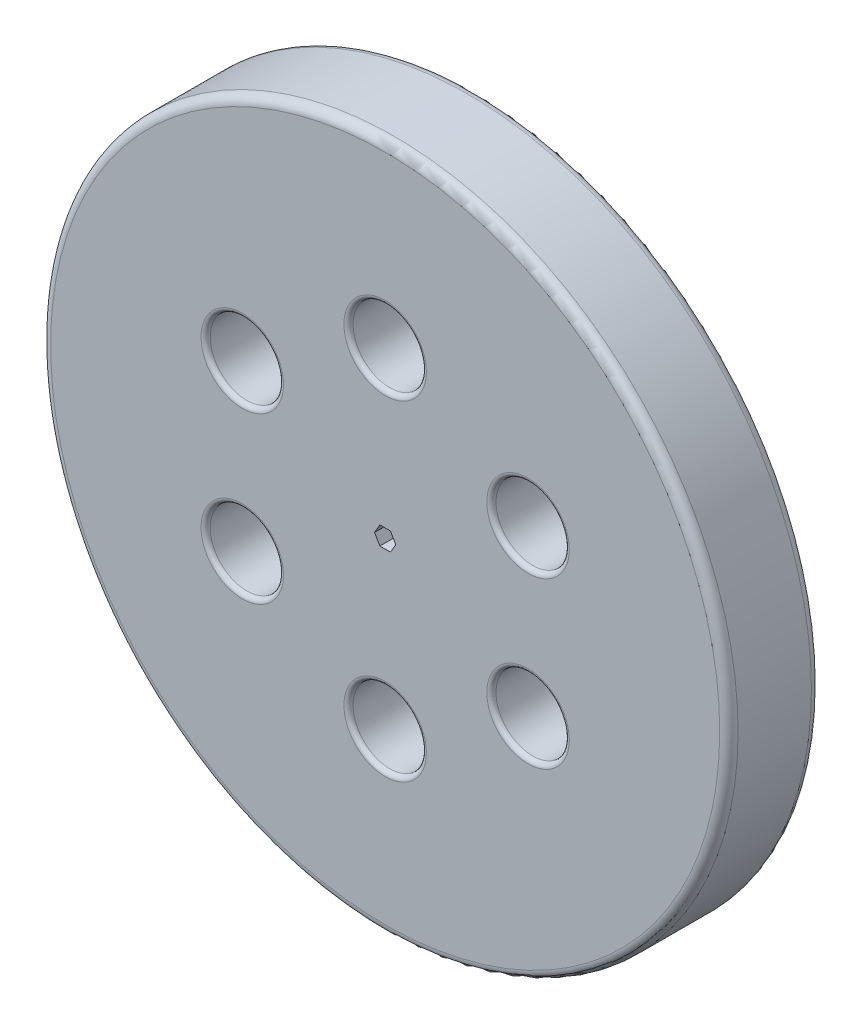
ISO-10303-21;
HEADER;
FILE_DESCRIPTION(('STEP AP214'),'2;1');
FILE_NAME('part.step','',(''),(''),'','','');
FILE_SCHEMA(('AUTOMOTIVE_DESIGN { 1 0 10303 214 1 1 1 1 }'));
ENDSEC;
DATA;
#1=APPLICATION_CONTEXT('core data for automotive mechanical design processes');
#2=APPLICATION_PROTOCOL_DEFINITION('international standard','automotive_design',2000,#1);
#3=PRODUCT_CONTEXT('',#1,'mechanical');
#4=PRODUCT('Part','Part','',(#3));
#5=PRODUCT_RELATED_PRODUCT_CATEGORY('part','',(#4));
#6=PRODUCT_DEFINITION_FORMATION('','',#4);
#7=PRODUCT_DEFINITION_CONTEXT('part definition',#1,'design');
#8=PRODUCT_DEFINITION('design','',#6,#7);
#9=PRODUCT_DEFINITION_SHAPE('','',#8);
#10=(LENGTH_UNIT() NAMED_UNIT(*) SI_UNIT(.MILLI.,.METRE.));
#11=(NAMED_UNIT(*) PLANE_ANGLE_UNIT() SI_UNIT($,.RADIAN.));
#12=(NAMED_UNIT(*) SI_UNIT($,.STERADIAN.) SOLID_ANGLE_UNIT());
#13=UNCERTAINTY_MEASURE_WITH_UNIT(LENGTH_MEASURE(1.E-05),#10,'distance_accuracy_value','');
#14=(GEOMETRIC_REPRESENTATION_CONTEXT(3) GLOBAL_UNCERTAINTY_ASSIGNED_CONTEXT((#13)) GLOBAL_UNIT_ASSIGNED_CONTEXT((#10,
#11,#12)) REPRESENTATION_CONTEXT('',''));
#15=CARTESIAN_POINT('',(0.,0.,0.));
#16=DIRECTION('',(0.,0.,1.));
#17=DIRECTION('',(1.,0.,0.));
#18=AXIS2_PLACEMENT_3D('',#15,#16,#17);
#19=CARTESIAN_POINT('',(0.,0.,10.));
#20=DIRECTION('',(0.,0.,-1.));
#21=DIRECTION('',(-1.,0.,0.));
#22=AXIS2_PLACEMENT_3D('',#19,#20,#21);
#23=CYLINDRICAL_SURFACE('',#22,37.5);
#24=CARTESIAN_POINT('',(0.,0.,0.999999999999999));
#25=DIRECTION('',(0.,0.,1.));
#26=DIRECTION('',(1.,0.,0.));
#27=AXIS2_PLACEMENT_3D('',#24,#25,#26);
#28=CIRCLE('',#27,37.5);
#29=CARTESIAN_POINT('',(37.5,0.,0.999999999999999));
#30=VERTEX_POINT('',#29);
#31=EDGE_CURVE('E135',#30,#30,#28,.T.);
#32=ORIENTED_EDGE('',*,*,#31,.T.);
#33=EDGE_LOOP('',(#32));
#34=FACE_BOUND('',#33,.T.);
#35=CARTESIAN_POINT('',(0.,0.,9.));
#36=DIRECTION('',(0.,0.,1.));
#37=DIRECTION('',(1.,0.,0.));
#38=AXIS2_PLACEMENT_3D('',#35,#36,#37);
#39=CIRCLE('',#38,37.5);
#40=CARTESIAN_POINT('',(37.5,0.,9.));
#41=VERTEX_POINT('',#40);
#42=EDGE_CURVE('E131',#41,#41,#39,.F.);
#43=ORIENTED_EDGE('',*,*,#42,.T.);
#44=EDGE_LOOP('',(#43));
#45=FACE_BOUND('',#44,.T.);
#46=ADVANCED_FACE('F37',(#34,#45),#23,.T.);
#47=CARTESIAN_POINT('',(0.,0.,10.));
#48=DIRECTION('',(0.,0.,1.));
#49=DIRECTION('',(1.,0.,0.));
#50=AXIS2_PLACEMENT_3D('',#47,#48,#49);
#51=PLANE('',#50);
#52=DIRECTION('',(0.5,0.866025403784439,0.));
#53=VECTOR('',#52,1.);
#54=CARTESIAN_POINT('',(0.577350269189626,-1.,10.));
#55=LINE('',#54,#53);
#56=CARTESIAN_POINT('',(0.577350269189626,-1.,10.));
#57=VERTEX_POINT('',#56);
#58=CARTESIAN_POINT('',(1.15470053837925,0.,10.));
#59=VERTEX_POINT('',#58);
#60=EDGE_CURVE('E52',#57,#59,#55,.T.);
#61=ORIENTED_EDGE('',*,*,#60,.F.);
#62=DIRECTION('',(1.,0.,0.));
#63=VECTOR('',#62,1.);
#64=CARTESIAN_POINT('',(-0.577350269189626,-1.,10.));
#65=LINE('',#64,#63);
#66=CARTESIAN_POINT('',(-0.577350269189626,-1.,10.));
#67=VERTEX_POINT('',#66);
#68=EDGE_CURVE('E118',#67,#57,#65,.T.);
#69=ORIENTED_EDGE('',*,*,#68,.F.);
#70=DIRECTION('',(0.5,-0.866025403784438,0.));
#71=VECTOR('',#70,1.);
#72=CARTESIAN_POINT('',(-1.15470053837925,0.,10.));
#73=LINE('',#72,#71);
#74=CARTESIAN_POINT('',(-1.15470053837925,0.,10.));
#75=VERTEX_POINT('',#74);
#76=EDGE_CURVE('E112',#75,#67,#73,.T.);
#77=ORIENTED_EDGE('',*,*,#76,.F.);
#78=DIRECTION('',(-0.5,-0.866025403784439,0.));
#79=VECTOR('',#78,1.);
#80=CARTESIAN_POINT('',(-0.577350269189626,1.,10.));
#81=LINE('',#80,#79);
#82=CARTESIAN_POINT('',(-0.577350269189626,1.,10.));
#83=VERTEX_POINT('',#82);
#84=EDGE_CURVE('E110',#83,#75,#81,.T.);
#85=ORIENTED_EDGE('',*,*,#84,.F.);
#86=DIRECTION('',(-1.,0.,0.));
#87=VECTOR('',#86,1.);
#88=CARTESIAN_POINT('',(0.577350269189625,1.,10.));
#89=LINE('',#88,#87);
#90=CARTESIAN_POINT('',(0.577350269189625,1.,10.));
#91=VERTEX_POINT('',#90);
#92=EDGE_CURVE('E93',#91,#83,#89,.T.);
#93=ORIENTED_EDGE('',*,*,#92,.F.);
#94=DIRECTION('',(-0.5,0.866025403784439,0.));
#95=VECTOR('',#94,1.);
#96=CARTESIAN_POINT('',(1.15470053837925,0.,10.));
#97=LINE('',#96,#95);
#98=EDGE_CURVE('E102',#59,#91,#97,.T.);
#99=ORIENTED_EDGE('',*,*,#98,.F.);
#100=EDGE_LOOP('',(#61,#69,#77,#85,#93,#99));
#101=FACE_BOUND('',#100,.T.);
#102=CARTESIAN_POINT('',(-15.5884572681199,-9.00000000000007,10.));
#103=DIRECTION('',(0.,0.,1.));
#104=DIRECTION('',(1.,0.,0.));
#105=AXIS2_PLACEMENT_3D('',#102,#103,#104);
#106=CIRCLE('',#105,4.5);
#107=CARTESIAN_POINT('',(-11.0884572681199,-9.00000000000007,10.));
#108=VERTEX_POINT('',#107);
#109=EDGE_CURVE('E165',#108,#108,#106,.F.);
#110=ORIENTED_EDGE('',*,*,#109,.T.);
#111=EDGE_LOOP('',(#110));
#112=FACE_BOUND('',#111,.T.);
#113=CARTESIAN_POINT('',(0.,-18.,10.));
#114=DIRECTION('',(0.,0.,1.));
#115=DIRECTION('',(1.,0.,0.));
#116=AXIS2_PLACEMENT_3D('',#113,#114,#115);
#117=CIRCLE('',#116,4.5);
#118=CARTESIAN_POINT('',(4.5,-18.,10.));
#119=VERTEX_POINT('',#118);
#120=EDGE_CURVE('E162',#119,#119,#117,.F.);
#121=ORIENTED_EDGE('',*,*,#120,.T.);
#122=EDGE_LOOP('',(#121));
#123=FACE_BOUND('',#122,.T.);
#124=CARTESIAN_POINT('',(15.58845726812,-8.99999999999985,10.));
#125=DIRECTION('',(0.,0.,1.));
#126=DIRECTION('',(1.,0.,0.));
#127=AXIS2_PLACEMENT_3D('',#124,#125,#126);
#128=CIRCLE('',#127,4.5);
#129=CARTESIAN_POINT('',(20.08845726812,-8.99999999999985,10.));
#130=VERTEX_POINT('',#129);
#131=EDGE_CURVE('E159',#130,#130,#128,.F.);
#132=ORIENTED_EDGE('',*,*,#131,.T.);
#133=EDGE_LOOP('',(#132));
#134=FACE_BOUND('',#133,.T.);
#135=CARTESIAN_POINT('',(15.5884572681198,9.00000000000018,10.));
#136=DIRECTION('',(0.,0.,1.));
#137=DIRECTION('',(1.,0.,0.));
#138=AXIS2_PLACEMENT_3D('',#135,#136,#137);
#139=CIRCLE('',#138,4.5);
#140=CARTESIAN_POINT('',(20.0884572681198,9.00000000000018,10.));
#141=VERTEX_POINT('',#140);
#142=EDGE_CURVE('E156',#141,#141,#139,.F.);
#143=ORIENTED_EDGE('',*,*,#142,.T.);
#144=EDGE_LOOP('',(#143));
#145=FACE_BOUND('',#144,.T.);
#146=CARTESIAN_POINT('',(0.,18.,10.));
#147=DIRECTION('',(0.,0.,1.));
#148=DIRECTION('',(1.,0.,0.));
#149=AXIS2_PLACEMENT_3D('',#146,#147,#148);
#150=CIRCLE('',#149,4.5);
#151=CARTESIAN_POINT('',(4.5,18.,10.));
#152=VERTEX_POINT('',#151);
#153=EDGE_CURVE('E153',#152,#152,#150,.F.);
#154=ORIENTED_EDGE('',*,*,#153,.T.);
#155=EDGE_LOOP('',(#154));
#156=FACE_BOUND('',#155,.T.);
#157=CARTESIAN_POINT('',(-15.5884572681199,8.99999999999996,10.));
#158=DIRECTION('',(0.,0.,1.));
#159=DIRECTION('',(1.,0.,0.));
#160=AXIS2_PLACEMENT_3D('',#157,#158,#159);
#161=CIRCLE('',#160,4.5);
#162=CARTESIAN_POINT('',(-11.0884572681199,8.99999999999996,10.));
#163=VERTEX_POINT('',#162);
#164=EDGE_CURVE('E150',#163,#163,#161,.F.);
#165=ORIENTED_EDGE('',*,*,#164,.T.);
#166=EDGE_LOOP('',(#165));
#167=FACE_BOUND('',#166,.T.);
#168=CARTESIAN_POINT('',(0.,0.,10.));
#169=DIRECTION('',(0.,0.,1.));
#170=DIRECTION('',(1.,0.,0.));
#171=AXIS2_PLACEMENT_3D('',#168,#169,#170);
#172=CIRCLE('',#171,36.5);
#173=CARTESIAN_POINT('',(36.5,0.,10.));
#174=VERTEX_POINT('',#173);
#175=EDGE_CURVE('E141',#174,#174,#172,.T.);
#176=ORIENTED_EDGE('',*,*,#175,.T.);
#177=EDGE_LOOP('',(#176));
#178=FACE_BOUND('',#177,.T.);
#179=ADVANCED_FACE('F106',(#101,#112,#123,#134,#145,#156,#167,#178),#51,.T.);
#180=CARTESIAN_POINT('',(0.,0.,0.));
#181=DIRECTION('',(0.,0.,1.));
#182=DIRECTION('',(1.,0.,0.));
#183=AXIS2_PLACEMENT_3D('',#180,#181,#182);
#184=PLANE('',#183);
#185=DIRECTION('',(-1.,0.,0.));
#186=VECTOR('',#185,1.);
#187=CARTESIAN_POINT('',(-0.577350269189626,-1.,0.));
#188=LINE('',#187,#186);
#189=CARTESIAN_POINT('',(0.577350269189626,-1.,0.));
#190=VERTEX_POINT('',#189);
#191=CARTESIAN_POINT('',(-0.577350269189626,-1.,0.));
#192=VERTEX_POINT('',#191);
#193=EDGE_CURVE('E310',#190,#192,#188,.T.);
#194=ORIENTED_EDGE('',*,*,#193,.F.);
#195=DIRECTION('',(-0.5,-0.866025403784439,0.));
#196=VECTOR('',#195,1.);
#197=CARTESIAN_POINT('',(0.577350269189626,-1.,0.));
#198=LINE('',#197,#196);
#199=CARTESIAN_POINT('',(1.15470053837925,0.,0.));
#200=VERTEX_POINT('',#199);
#201=EDGE_CURVE('E132',#200,#190,#198,.T.);
#202=ORIENTED_EDGE('',*,*,#201,.F.);
#203=DIRECTION('',(0.5,-0.866025403784439,0.));
#204=VECTOR('',#203,1.);
#205=CARTESIAN_POINT('',(1.15470053837925,0.,0.));
#206=LINE('',#205,#204);
#207=CARTESIAN_POINT('',(0.577350269189625,1.,0.));
#208=VERTEX_POINT('',#207);
#209=EDGE_CURVE('E129',#208,#200,#206,.T.);
#210=ORIENTED_EDGE('',*,*,#209,.F.);
#211=DIRECTION('',(1.,0.,0.));
#212=VECTOR('',#211,1.);
#213=CARTESIAN_POINT('',(0.577350269189625,1.,0.));
#214=LINE('',#213,#212);
#215=CARTESIAN_POINT('',(-0.577350269189626,1.,0.));
#216=VERTEX_POINT('',#215);
#217=EDGE_CURVE('E96',#216,#208,#214,.T.);
#218=ORIENTED_EDGE('',*,*,#217,.F.);
#219=DIRECTION('',(0.5,0.866025403784439,0.));
#220=VECTOR('',#219,1.);
#221=CARTESIAN_POINT('',(-0.577350269189626,1.,0.));
#222=LINE('',#221,#220);
#223=CARTESIAN_POINT('',(-1.15470053837925,0.,0.));
#224=VERTEX_POINT('',#223);
#225=EDGE_CURVE('E329',#224,#216,#222,.T.);
#226=ORIENTED_EDGE('',*,*,#225,.F.);
#227=DIRECTION('',(-0.5,0.866025403784438,0.));
#228=VECTOR('',#227,1.);
#229=CARTESIAN_POINT('',(-1.15470053837925,0.,0.));
#230=LINE('',#229,#228);
#231=EDGE_CURVE('E323',#192,#224,#230,.T.);
#232=ORIENTED_EDGE('',*,*,#231,.F.);
#233=EDGE_LOOP('',(#194,#202,#210,#218,#226,#232));
#234=FACE_BOUND('',#233,.T.);
#235=CARTESIAN_POINT('',(-15.5884572681199,-9.00000000000007,0.));
#236=DIRECTION('',(0.,0.,1.));
#237=DIRECTION('',(1.,0.,0.));
#238=AXIS2_PLACEMENT_3D('',#235,#236,#237);
#239=CIRCLE('',#238,4.5);
#240=CARTESIAN_POINT('',(-11.0884572681199,-9.00000000000007,0.));
#241=VERTEX_POINT('',#240);
#242=EDGE_CURVE('E183',#241,#241,#239,.T.);
#243=ORIENTED_EDGE('',*,*,#242,.T.);
#244=EDGE_LOOP('',(#243));
#245=FACE_BOUND('',#244,.T.);
#246=CARTESIAN_POINT('',(0.,-18.,0.));
#247=DIRECTION('',(0.,0.,1.));
#248=DIRECTION('',(1.,0.,0.));
#249=AXIS2_PLACEMENT_3D('',#246,#247,#248);
#250=CIRCLE('',#249,4.5);
#251=CARTESIAN_POINT('',(4.5,-18.,0.));
#252=VERTEX_POINT('',#251);
#253=EDGE_CURVE('E180',#252,#252,#250,.T.);
#254=ORIENTED_EDGE('',*,*,#253,.T.);
#255=EDGE_LOOP('',(#254));
#256=FACE_BOUND('',#255,.T.);
#257=CARTESIAN_POINT('',(15.58845726812,-8.99999999999985,0.));
#258=DIRECTION('',(0.,0.,1.));
#259=DIRECTION('',(1.,0.,0.));
#260=AXIS2_PLACEMENT_3D('',#257,#258,#259);
#261=CIRCLE('',#260,4.5);
#262=CARTESIAN_POINT('',(20.08845726812,-8.99999999999985,0.));
#263=VERTEX_POINT('',#262);
#264=EDGE_CURVE('E177',#263,#263,#261,.T.);
#265=ORIENTED_EDGE('',*,*,#264,.T.);
#266=EDGE_LOOP('',(#265));
#267=FACE_BOUND('',#266,.T.);
#268=CARTESIAN_POINT('',(15.5884572681198,9.00000000000018,0.));
#269=DIRECTION('',(0.,0.,1.));
#270=DIRECTION('',(1.,0.,0.));
#271=AXIS2_PLACEMENT_3D('',#268,#269,#270);
#272=CIRCLE('',#271,4.5);
#273=CARTESIAN_POINT('',(20.0884572681198,9.00000000000018,0.));
#274=VERTEX_POINT('',#273);
#275=EDGE_CURVE('E174',#274,#274,#272,.T.);
#276=ORIENTED_EDGE('',*,*,#275,.T.);
#277=EDGE_LOOP('',(#276));
#278=FACE_BOUND('',#277,.T.);
#279=CARTESIAN_POINT('',(0.,18.,0.));
#280=DIRECTION('',(0.,0.,1.));
#281=DIRECTION('',(1.,0.,0.));
#282=AXIS2_PLACEMENT_3D('',#279,#280,#281);
#283=CIRCLE('',#282,4.5);
#284=CARTESIAN_POINT('',(4.5,18.,0.));
#285=VERTEX_POINT('',#284);
#286=EDGE_CURVE('E171',#285,#285,#283,.T.);
#287=ORIENTED_EDGE('',*,*,#286,.T.);
#288=EDGE_LOOP('',(#287));
#289=FACE_BOUND('',#288,.T.);
#290=CARTESIAN_POINT('',(-15.5884572681199,8.99999999999996,0.));
#291=DIRECTION('',(0.,0.,1.));
#292=DIRECTION('',(1.,0.,0.));
#293=AXIS2_PLACEMENT_3D('',#290,#291,#292);
#294=CIRCLE('',#293,4.5);
#295=CARTESIAN_POINT('',(-11.0884572681199,8.99999999999996,0.));
#296=VERTEX_POINT('',#295);
#297=EDGE_CURVE('E168',#296,#296,#294,.T.);
#298=ORIENTED_EDGE('',*,*,#297,.T.);
#299=EDGE_LOOP('',(#298));
#300=FACE_BOUND('',#299,.T.);
#301=CARTESIAN_POINT('',(0.,0.,0.));
#302=DIRECTION('',(0.,0.,1.));
#303=DIRECTION('',(1.,0.,0.));
#304=AXIS2_PLACEMENT_3D('',#301,#302,#303);
#305=CIRCLE('',#304,36.5);
#306=CARTESIAN_POINT('',(36.5,0.,0.));
#307=VERTEX_POINT('',#306);
#308=EDGE_CURVE('E138',#307,#307,#305,.F.);
#309=ORIENTED_EDGE('',*,*,#308,.T.);
#310=EDGE_LOOP('',(#309));
#311=FACE_BOUND('',#310,.T.);
#312=ADVANCED_FACE('F233',(#234,#245,#256,#267,#278,#289,#300,#311),#184,.F.);
#313=CARTESIAN_POINT('',(0.,18.,0.));
#314=DIRECTION('',(0.,0.,1.));
#315=DIRECTION('',(1.,0.,0.));
#316=AXIS2_PLACEMENT_3D('',#313,#314,#315);
#317=CYLINDRICAL_SURFACE('',#316,4.);
#318=CARTESIAN_POINT('',(0.,18.,9.5));
#319=DIRECTION('',(0.,0.,1.));
#320=DIRECTION('',(1.,0.,0.));
#321=AXIS2_PLACEMENT_3D('',#318,#319,#320);
#322=CIRCLE('',#321,4.);
#323=CARTESIAN_POINT('',(4.,18.,9.5));
#324=VERTEX_POINT('',#323);
#325=EDGE_CURVE('E207',#324,#324,#322,.T.);
#326=ORIENTED_EDGE('',*,*,#325,.T.);
#327=EDGE_LOOP('',(#326));
#328=FACE_BOUND('',#327,.T.);
#329=CARTESIAN_POINT('',(0.,18.,0.5));
#330=DIRECTION('',(0.,0.,1.));
#331=DIRECTION('',(1.,0.,0.));
#332=AXIS2_PLACEMENT_3D('',#329,#330,#331);
#333=CIRCLE('',#332,4.);
#334=CARTESIAN_POINT('',(4.,18.,0.5));
#335=VERTEX_POINT('',#334);
#336=EDGE_CURVE('E204',#335,#335,#333,.F.);
#337=ORIENTED_EDGE('',*,*,#336,.T.);
#338=EDGE_LOOP('',(#337));
#339=FACE_BOUND('',#338,.T.);
#340=ADVANCED_FACE('F293',(#328,#339),#317,.F.);
#341=CARTESIAN_POINT('',(-15.5884572681199,8.99999999999996,0.));
#342=DIRECTION('',(0.,0.,1.));
#343=DIRECTION('',(1.,0.,0.));
#344=AXIS2_PLACEMENT_3D('',#341,#342,#343);
#345=CYLINDRICAL_SURFACE('',#344,4.);
#346=CARTESIAN_POINT('',(-15.5884572681199,8.99999999999996,0.5));
#347=DIRECTION('',(0.,0.,1.));
#348=DIRECTION('',(1.,0.,0.));
#349=AXIS2_PLACEMENT_3D('',#346,#347,#348);
#350=CIRCLE('',#349,4.);
#351=CARTESIAN_POINT('',(-11.5884572681199,8.99999999999996,0.5));
#352=VERTEX_POINT('',#351);
#353=EDGE_CURVE('E11',#352,#352,#350,.F.);
#354=ORIENTED_EDGE('',*,*,#353,.T.);
#355=EDGE_LOOP('',(#354));
#356=FACE_BOUND('',#355,.T.);
#357=CARTESIAN_POINT('',(-15.5884572681199,8.99999999999996,9.5));
#358=DIRECTION('',(0.,0.,1.));
#359=DIRECTION('',(1.,0.,0.));
#360=AXIS2_PLACEMENT_3D('',#357,#358,#359);
#361=CIRCLE('',#360,4.);
#362=CARTESIAN_POINT('',(-11.5884572681199,8.99999999999996,9.5));
#363=VERTEX_POINT('',#362);
#364=EDGE_CURVE('E45',#363,#363,#361,.T.);
#365=ORIENTED_EDGE('',*,*,#364,.T.);
#366=EDGE_LOOP('',(#365));
#367=FACE_BOUND('',#366,.T.);
#368=ADVANCED_FACE('F212',(#356,#367),#345,.F.);
#369=CARTESIAN_POINT('',(-15.5884572681199,-9.00000000000007,0.));
#370=DIRECTION('',(0.,0.,1.));
#371=DIRECTION('',(1.,0.,0.));
#372=AXIS2_PLACEMENT_3D('',#369,#370,#371);
#373=CYLINDRICAL_SURFACE('',#372,4.);
#374=CARTESIAN_POINT('',(-15.5884572681199,-9.00000000000007,9.5));
#375=DIRECTION('',(0.,0.,1.));
#376=DIRECTION('',(1.,0.,0.));
#377=AXIS2_PLACEMENT_3D('',#374,#375,#376);
#378=CIRCLE('',#377,4.);
#379=CARTESIAN_POINT('',(-11.5884572681199,-9.00000000000007,9.5));
#380=VERTEX_POINT('',#379);
#381=EDGE_CURVE('E147',#380,#380,#378,.T.);
#382=ORIENTED_EDGE('',*,*,#381,.T.);
#383=EDGE_LOOP('',(#382));
#384=FACE_BOUND('',#383,.T.);
#385=CARTESIAN_POINT('',(-15.5884572681199,-9.00000000000007,0.5));
#386=DIRECTION('',(0.,0.,1.));
#387=DIRECTION('',(1.,0.,0.));
#388=AXIS2_PLACEMENT_3D('',#385,#386,#387);
#389=CIRCLE('',#388,4.);
#390=CARTESIAN_POINT('',(-11.5884572681199,-9.00000000000007,0.5));
#391=VERTEX_POINT('',#390);
#392=EDGE_CURVE('E144',#391,#391,#389,.F.);
#393=ORIENTED_EDGE('',*,*,#392,.T.);
#394=EDGE_LOOP('',(#393));
#395=FACE_BOUND('',#394,.T.);
#396=ADVANCED_FACE('F352',(#384,#395),#373,.F.);
#397=CARTESIAN_POINT('',(0.,-18.,0.));
#398=DIRECTION('',(0.,0.,1.));
#399=DIRECTION('',(1.,0.,0.));
#400=AXIS2_PLACEMENT_3D('',#397,#398,#399);
#401=CYLINDRICAL_SURFACE('',#400,4.);
#402=CARTESIAN_POINT('',(0.,-18.,0.5));
#403=DIRECTION('',(0.,0.,1.));
#404=DIRECTION('',(1.,0.,0.));
#405=AXIS2_PLACEMENT_3D('',#402,#403,#404);
#406=CIRCLE('',#405,4.);
#407=CARTESIAN_POINT('',(4.,-18.,0.5));
#408=VERTEX_POINT('',#407);
#409=EDGE_CURVE('E189',#408,#408,#406,.F.);
#410=ORIENTED_EDGE('',*,*,#409,.T.);
#411=EDGE_LOOP('',(#410));
#412=FACE_BOUND('',#411,.T.);
#413=CARTESIAN_POINT('',(0.,-18.,9.5));
#414=DIRECTION('',(0.,0.,1.));
#415=DIRECTION('',(1.,0.,0.));
#416=AXIS2_PLACEMENT_3D('',#413,#414,#415);
#417=CIRCLE('',#416,4.);
#418=CARTESIAN_POINT('',(4.,-18.,9.5));
#419=VERTEX_POINT('',#418);
#420=EDGE_CURVE('E186',#419,#419,#417,.T.);
#421=ORIENTED_EDGE('',*,*,#420,.T.);
#422=EDGE_LOOP('',(#421));
#423=FACE_BOUND('',#422,.T.);
#424=ADVANCED_FACE('F355',(#412,#423),#401,.F.);
#425=CARTESIAN_POINT('',(15.58845726812,-8.99999999999985,0.));
#426=DIRECTION('',(0.,0.,1.));
#427=DIRECTION('',(1.,0.,0.));
#428=AXIS2_PLACEMENT_3D('',#425,#426,#427);
#429=CYLINDRICAL_SURFACE('',#428,4.);
#430=CARTESIAN_POINT('',(15.58845726812,-8.99999999999985,9.5));
#431=DIRECTION('',(0.,0.,1.));
#432=DIRECTION('',(1.,0.,0.));
#433=AXIS2_PLACEMENT_3D('',#430,#431,#432);
#434=CIRCLE('',#433,4.);
#435=CARTESIAN_POINT('',(19.58845726812,-8.99999999999985,9.5));
#436=VERTEX_POINT('',#435);
#437=EDGE_CURVE('E195',#436,#436,#434,.T.);
#438=ORIENTED_EDGE('',*,*,#437,.T.);
#439=EDGE_LOOP('',(#438));
#440=FACE_BOUND('',#439,.T.);
#441=CARTESIAN_POINT('',(15.58845726812,-8.99999999999985,0.5));
#442=DIRECTION('',(0.,0.,1.));
#443=DIRECTION('',(1.,0.,0.));
#444=AXIS2_PLACEMENT_3D('',#441,#442,#443);
#445=CIRCLE('',#444,4.);
#446=CARTESIAN_POINT('',(19.58845726812,-8.99999999999985,0.5));
#447=VERTEX_POINT('',#446);
#448=EDGE_CURVE('E192',#447,#447,#445,.F.);
#449=ORIENTED_EDGE('',*,*,#448,.T.);
#450=EDGE_LOOP('',(#449));
#451=FACE_BOUND('',#450,.T.);
#452=ADVANCED_FACE('F359',(#440,#451),#429,.F.);
#453=CARTESIAN_POINT('',(15.5884572681198,9.00000000000018,0.));
#454=DIRECTION('',(0.,0.,1.));
#455=DIRECTION('',(1.,0.,0.));
#456=AXIS2_PLACEMENT_3D('',#453,#454,#455);
#457=CYLINDRICAL_SURFACE('',#456,4.);
#458=CARTESIAN_POINT('',(15.5884572681198,9.00000000000018,0.5));
#459=DIRECTION('',(0.,0.,1.));
#460=DIRECTION('',(1.,0.,0.));
#461=AXIS2_PLACEMENT_3D('',#458,#459,#460);
#462=CIRCLE('',#461,4.);
#463=CARTESIAN_POINT('',(19.5884572681198,9.00000000000018,0.5));
#464=VERTEX_POINT('',#463);
#465=EDGE_CURVE('E201',#464,#464,#462,.F.);
#466=ORIENTED_EDGE('',*,*,#465,.T.);
#467=EDGE_LOOP('',(#466));
#468=FACE_BOUND('',#467,.T.);
#469=CARTESIAN_POINT('',(15.5884572681198,9.00000000000018,9.5));
#470=DIRECTION('',(0.,0.,1.));
#471=DIRECTION('',(1.,0.,0.));
#472=AXIS2_PLACEMENT_3D('',#469,#470,#471);
#473=CIRCLE('',#472,4.);
#474=CARTESIAN_POINT('',(19.5884572681198,9.00000000000018,9.5));
#475=VERTEX_POINT('',#474);
#476=EDGE_CURVE('E198',#475,#475,#473,.T.);
#477=ORIENTED_EDGE('',*,*,#476,.T.);
#478=EDGE_LOOP('',(#477));
#479=FACE_BOUND('',#478,.T.);
#480=ADVANCED_FACE('F242',(#468,#479),#457,.F.);
#481=CARTESIAN_POINT('',(0.,0.,0.999999999999999));
#482=DIRECTION('',(0.,0.,1.));
#483=DIRECTION('',(1.,0.,0.));
#484=AXIS2_PLACEMENT_3D('',#481,#482,#483);
#485=TOROIDAL_SURFACE('',#484,36.5,1.);
#486=ORIENTED_EDGE('',*,*,#308,.F.);
#487=EDGE_LOOP('',(#486));
#488=FACE_BOUND('',#487,.T.);
#489=ORIENTED_EDGE('',*,*,#31,.F.);
#490=EDGE_LOOP('',(#489));
#491=FACE_BOUND('',#490,.T.);
#492=ADVANCED_FACE('F238',(#488,#491),#485,.T.);
#493=CARTESIAN_POINT('',(0.,0.,9.));
#494=DIRECTION('',(0.,0.,1.));
#495=DIRECTION('',(1.,0.,0.));
#496=AXIS2_PLACEMENT_3D('',#493,#494,#495);
#497=TOROIDAL_SURFACE('',#496,36.5,1.);
#498=ORIENTED_EDGE('',*,*,#42,.F.);
#499=EDGE_LOOP('',(#498));
#500=FACE_BOUND('',#499,.T.);
#501=ORIENTED_EDGE('',*,*,#175,.F.);
#502=EDGE_LOOP('',(#501));
#503=FACE_BOUND('',#502,.T.);
#504=ADVANCED_FACE('F241',(#500,#503),#497,.T.);
#505=CARTESIAN_POINT('',(-15.5884572681199,-9.00000000000007,9.5));
#506=DIRECTION('',(0.,0.,1.));
#507=DIRECTION('',(1.,0.,0.));
#508=AXIS2_PLACEMENT_3D('',#505,#506,#507);
#509=TOROIDAL_SURFACE('',#508,4.5,0.5);
#510=ORIENTED_EDGE('',*,*,#109,.F.);
#511=EDGE_LOOP('',(#510));
#512=FACE_BOUND('',#511,.T.);
#513=ORIENTED_EDGE('',*,*,#381,.F.);
#514=EDGE_LOOP('',(#513));
#515=FACE_BOUND('',#514,.T.);
#516=ADVANCED_FACE('F246',(#512,#515),#509,.T.);
#517=CARTESIAN_POINT('',(-15.5884572681199,-9.00000000000007,0.5));
#518=DIRECTION('',(0.,0.,1.));
#519=DIRECTION('',(1.,0.,0.));
#520=AXIS2_PLACEMENT_3D('',#517,#518,#519);
#521=TOROIDAL_SURFACE('',#520,4.5,0.5);
#522=ORIENTED_EDGE('',*,*,#392,.F.);
#523=EDGE_LOOP('',(#522));
#524=FACE_BOUND('',#523,.T.);
#525=ORIENTED_EDGE('',*,*,#242,.F.);
#526=EDGE_LOOP('',(#525));
#527=FACE_BOUND('',#526,.T.);
#528=ADVANCED_FACE('F250',(#524,#527),#521,.T.);
#529=CARTESIAN_POINT('',(0.,-18.,0.5));
#530=DIRECTION('',(0.,0.,1.));
#531=DIRECTION('',(1.,0.,0.));
#532=AXIS2_PLACEMENT_3D('',#529,#530,#531);
#533=TOROIDAL_SURFACE('',#532,4.5,0.5);
#534=ORIENTED_EDGE('',*,*,#409,.F.);
#535=EDGE_LOOP('',(#534));
#536=FACE_BOUND('',#535,.T.);
#537=ORIENTED_EDGE('',*,*,#253,.F.);
#538=EDGE_LOOP('',(#537));
#539=FACE_BOUND('',#538,.T.);
#540=ADVANCED_FACE('F254',(#536,#539),#533,.T.);
#541=CARTESIAN_POINT('',(0.,-18.,9.5));
#542=DIRECTION('',(0.,0.,1.));
#543=DIRECTION('',(1.,0.,0.));
#544=AXIS2_PLACEMENT_3D('',#541,#542,#543);
#545=TOROIDAL_SURFACE('',#544,4.5,0.5);
#546=ORIENTED_EDGE('',*,*,#120,.F.);
#547=EDGE_LOOP('',(#546));
#548=FACE_BOUND('',#547,.T.);
#549=ORIENTED_EDGE('',*,*,#420,.F.);
#550=EDGE_LOOP('',(#549));
#551=FACE_BOUND('',#550,.T.);
#552=ADVANCED_FACE('F258',(#548,#551),#545,.T.);
#553=CARTESIAN_POINT('',(15.58845726812,-8.99999999999985,9.5));
#554=DIRECTION('',(0.,0.,1.));
#555=DIRECTION('',(1.,0.,0.));
#556=AXIS2_PLACEMENT_3D('',#553,#554,#555);
#557=TOROIDAL_SURFACE('',#556,4.5,0.5);
#558=ORIENTED_EDGE('',*,*,#131,.F.);
#559=EDGE_LOOP('',(#558));
#560=FACE_BOUND('',#559,.T.);
#561=ORIENTED_EDGE('',*,*,#437,.F.);
#562=EDGE_LOOP('',(#561));
#563=FACE_BOUND('',#562,.T.);
#564=ADVANCED_FACE('F262',(#560,#563),#557,.T.);
#565=CARTESIAN_POINT('',(15.58845726812,-8.99999999999985,0.5));
#566=DIRECTION('',(0.,0.,1.));
#567=DIRECTION('',(1.,0.,0.));
#568=AXIS2_PLACEMENT_3D('',#565,#566,#567);
#569=TOROIDAL_SURFACE('',#568,4.5,0.5);
#570=ORIENTED_EDGE('',*,*,#448,.F.);
#571=EDGE_LOOP('',(#570));
#572=FACE_BOUND('',#571,.T.);
#573=ORIENTED_EDGE('',*,*,#264,.F.);
#574=EDGE_LOOP('',(#573));
#575=FACE_BOUND('',#574,.T.);
#576=ADVANCED_FACE('F266',(#572,#575),#569,.T.);
#577=CARTESIAN_POINT('',(15.5884572681198,9.00000000000018,0.5));
#578=DIRECTION('',(0.,0.,1.));
#579=DIRECTION('',(1.,0.,0.));
#580=AXIS2_PLACEMENT_3D('',#577,#578,#579);
#581=TOROIDAL_SURFACE('',#580,4.5,0.5);
#582=ORIENTED_EDGE('',*,*,#465,.F.);
#583=EDGE_LOOP('',(#582));
#584=FACE_BOUND('',#583,.T.);
#585=ORIENTED_EDGE('',*,*,#275,.F.);
#586=EDGE_LOOP('',(#585));
#587=FACE_BOUND('',#586,.T.);
#588=ADVANCED_FACE('F270',(#584,#587),#581,.T.);
#589=CARTESIAN_POINT('',(15.5884572681198,9.00000000000018,9.5));
#590=DIRECTION('',(0.,0.,1.));
#591=DIRECTION('',(1.,0.,0.));
#592=AXIS2_PLACEMENT_3D('',#589,#590,#591);
#593=TOROIDAL_SURFACE('',#592,4.5,0.5);
#594=ORIENTED_EDGE('',*,*,#142,.F.);
#595=EDGE_LOOP('',(#594));
#596=FACE_BOUND('',#595,.T.);
#597=ORIENTED_EDGE('',*,*,#476,.F.);
#598=EDGE_LOOP('',(#597));
#599=FACE_BOUND('',#598,.T.);
#600=ADVANCED_FACE('F274',(#596,#599),#593,.T.);
#601=CARTESIAN_POINT('',(0.,18.,9.5));
#602=DIRECTION('',(0.,0.,1.));
#603=DIRECTION('',(1.,0.,0.));
#604=AXIS2_PLACEMENT_3D('',#601,#602,#603);
#605=TOROIDAL_SURFACE('',#604,4.5,0.5);
#606=ORIENTED_EDGE('',*,*,#153,.F.);
#607=EDGE_LOOP('',(#606));
#608=FACE_BOUND('',#607,.T.);
#609=ORIENTED_EDGE('',*,*,#325,.F.);
#610=EDGE_LOOP('',(#609));
#611=FACE_BOUND('',#610,.T.);
#612=ADVANCED_FACE('F278',(#608,#611),#605,.T.);
#613=CARTESIAN_POINT('',(0.,18.,0.5));
#614=DIRECTION('',(0.,0.,1.));
#615=DIRECTION('',(1.,0.,0.));
#616=AXIS2_PLACEMENT_3D('',#613,#614,#615);
#617=TOROIDAL_SURFACE('',#616,4.5,0.5);
#618=ORIENTED_EDGE('',*,*,#336,.F.);
#619=EDGE_LOOP('',(#618));
#620=FACE_BOUND('',#619,.T.);
#621=ORIENTED_EDGE('',*,*,#286,.F.);
#622=EDGE_LOOP('',(#621));
#623=FACE_BOUND('',#622,.T.);
#624=ADVANCED_FACE('F224',(#620,#623),#617,.T.);
#625=CARTESIAN_POINT('',(-15.5884572681199,8.99999999999996,0.5));
#626=DIRECTION('',(0.,0.,1.));
#627=DIRECTION('',(1.,0.,0.));
#628=AXIS2_PLACEMENT_3D('',#625,#626,#627);
#629=TOROIDAL_SURFACE('',#628,4.5,0.5);
#630=ORIENTED_EDGE('',*,*,#353,.F.);
#631=EDGE_LOOP('',(#630));
#632=FACE_BOUND('',#631,.T.);
#633=ORIENTED_EDGE('',*,*,#297,.F.);
#634=EDGE_LOOP('',(#633));
#635=FACE_BOUND('',#634,.T.);
#636=ADVANCED_FACE('F216',(#632,#635),#629,.T.);
#637=CARTESIAN_POINT('',(-15.5884572681199,8.99999999999996,9.5));
#638=DIRECTION('',(0.,0.,1.));
#639=DIRECTION('',(1.,0.,0.));
#640=AXIS2_PLACEMENT_3D('',#637,#638,#639);
#641=TOROIDAL_SURFACE('',#640,4.5,0.5);
#642=ORIENTED_EDGE('',*,*,#164,.F.);
#643=EDGE_LOOP('',(#642));
#644=FACE_BOUND('',#643,.T.);
#645=ORIENTED_EDGE('',*,*,#364,.F.);
#646=EDGE_LOOP('',(#645));
#647=FACE_BOUND('',#646,.T.);
#648=ADVANCED_FACE('F39',(#644,#647),#641,.T.);
#649=CARTESIAN_POINT('',(0.577350269189626,-1.,-3.0550504633039));
#650=DIRECTION('',(0.866025403784439,-0.5,0.));
#651=DIRECTION('',(0.5,0.866025403784439,0.));
#652=AXIS2_PLACEMENT_3D('',#649,#650,#651);
#653=PLANE('',#652);
#654=ORIENTED_EDGE('',*,*,#201,.T.);
#655=DIRECTION('',(0.,0.,1.));
#656=VECTOR('',#655,1.);
#657=CARTESIAN_POINT('',(0.577350269189626,-1.,-3.0550504633039));
#658=LINE('',#657,#656);
#659=EDGE_CURVE('E121',#190,#57,#658,.T.);
#660=ORIENTED_EDGE('',*,*,#659,.T.);
#661=ORIENTED_EDGE('',*,*,#60,.T.);
#662=DIRECTION('',(0.,0.,1.));
#663=VECTOR('',#662,1.);
#664=CARTESIAN_POINT('',(1.15470053837925,0.,-3.0550504633039));
#665=LINE('',#664,#663);
#666=EDGE_CURVE('E99',#200,#59,#665,.T.);
#667=ORIENTED_EDGE('',*,*,#666,.F.);
#668=EDGE_LOOP('',(#654,#660,#661,#667));
#669=FACE_BOUND('',#668,.T.);
#670=ADVANCED_FACE('F215',(#669),#653,.F.);
#671=CARTESIAN_POINT('',(-0.577350269189626,-1.,-3.0550504633039));
#672=DIRECTION('',(0.,-1.,0.));
#673=DIRECTION('',(0.,0.,-1.));
#674=AXIS2_PLACEMENT_3D('',#671,#672,#673);
#675=PLANE('',#674);
#676=ORIENTED_EDGE('',*,*,#193,.T.);
#677=DIRECTION('',(0.,0.,1.));
#678=VECTOR('',#677,1.);
#679=CARTESIAN_POINT('',(-0.577350269189626,-1.,-3.0550504633039));
#680=LINE('',#679,#678);
#681=EDGE_CURVE('E123',#192,#67,#680,.T.);
#682=ORIENTED_EDGE('',*,*,#681,.T.);
#683=ORIENTED_EDGE('',*,*,#68,.T.);
#684=ORIENTED_EDGE('',*,*,#659,.F.);
#685=EDGE_LOOP('',(#676,#682,#683,#684));
#686=FACE_BOUND('',#685,.T.);
#687=ADVANCED_FACE('F222',(#686),#675,.F.);
#688=CARTESIAN_POINT('',(-1.15470053837925,0.,-3.0550504633039));
#689=DIRECTION('',(-0.866025403784439,-0.5,0.));
#690=DIRECTION('',(0.5,-0.866025403784438,0.));
#691=AXIS2_PLACEMENT_3D('',#688,#689,#690);
#692=PLANE('',#691);
#693=ORIENTED_EDGE('',*,*,#231,.T.);
#694=DIRECTION('',(0.,0.,1.));
#695=VECTOR('',#694,1.);
#696=CARTESIAN_POINT('',(-1.15470053837925,0.,-3.0550504633039));
#697=LINE('',#696,#695);
#698=EDGE_CURVE('E125',#224,#75,#697,.T.);
#699=ORIENTED_EDGE('',*,*,#698,.T.);
#700=ORIENTED_EDGE('',*,*,#76,.T.);
#701=ORIENTED_EDGE('',*,*,#681,.F.);
#702=EDGE_LOOP('',(#693,#699,#700,#701));
#703=FACE_BOUND('',#702,.T.);
#704=ADVANCED_FACE('F338',(#703),#692,.F.);
#705=CARTESIAN_POINT('',(-0.577350269189626,1.,-3.0550504633039));
#706=DIRECTION('',(-0.866025403784439,0.5,0.));
#707=DIRECTION('',(-0.5,-0.866025403784439,0.));
#708=AXIS2_PLACEMENT_3D('',#705,#706,#707);
#709=PLANE('',#708);
#710=ORIENTED_EDGE('',*,*,#225,.T.);
#711=DIRECTION('',(0.,0.,1.));
#712=VECTOR('',#711,1.);
#713=CARTESIAN_POINT('',(-0.577350269189626,1.,-3.0550504633039));
#714=LINE('',#713,#712);
#715=EDGE_CURVE('E98',#216,#83,#714,.T.);
#716=ORIENTED_EDGE('',*,*,#715,.T.);
#717=ORIENTED_EDGE('',*,*,#84,.T.);
#718=ORIENTED_EDGE('',*,*,#698,.F.);
#719=EDGE_LOOP('',(#710,#716,#717,#718));
#720=FACE_BOUND('',#719,.T.);
#721=ADVANCED_FACE('F335',(#720),#709,.F.);
#722=CARTESIAN_POINT('',(0.577350269189625,1.,-3.0550504633039));
#723=DIRECTION('',(0.,1.,0.));
#724=DIRECTION('',(0.,0.,1.));
#725=AXIS2_PLACEMENT_3D('',#722,#723,#724);
#726=PLANE('',#725);
#727=ORIENTED_EDGE('',*,*,#217,.T.);
#728=DIRECTION('',(0.,0.,1.));
#729=VECTOR('',#728,1.);
#730=CARTESIAN_POINT('',(0.577350269189625,1.,-3.0550504633039));
#731=LINE('',#730,#729);
#732=EDGE_CURVE('E60',#208,#91,#731,.T.);
#733=ORIENTED_EDGE('',*,*,#732,.T.);
#734=ORIENTED_EDGE('',*,*,#92,.T.);
#735=ORIENTED_EDGE('',*,*,#715,.F.);
#736=EDGE_LOOP('',(#727,#733,#734,#735));
#737=FACE_BOUND('',#736,.T.);
#738=ADVANCED_FACE('F90',(#737),#726,.F.);
#739=CARTESIAN_POINT('',(1.15470053837925,0.,-3.0550504633039));
#740=DIRECTION('',(0.866025403784438,0.5,0.));
#741=DIRECTION('',(-0.5,0.866025403784439,0.));
#742=AXIS2_PLACEMENT_3D('',#739,#740,#741);
#743=PLANE('',#742);
#744=ORIENTED_EDGE('',*,*,#209,.T.);
#745=ORIENTED_EDGE('',*,*,#666,.T.);
#746=ORIENTED_EDGE('',*,*,#98,.T.);
#747=ORIENTED_EDGE('',*,*,#732,.F.);
#748=EDGE_LOOP('',(#744,#745,#746,#747));
#749=FACE_BOUND('',#748,.T.);
#750=ADVANCED_FACE('F103',(#749),#743,.F.);
#751=CLOSED_SHELL('',(#46,#179,#312,#340,#368,#396,#424,#452,#480,#492,#504,#516,#528,#540,#552,
#564,#576,#588,#600,#612,#624,#636,#648,#670,#687,#704,#721,#738,#750));
#752=MANIFOLD_SOLID_BREP('B2',#751);
#753=ADVANCED_BREP_SHAPE_REPRESENTATION('',(#18,#752),#14);
#754=SHAPE_DEFINITION_REPRESENTATION(#9,#753);
ENDSEC;
END-ISO-10303-21;
